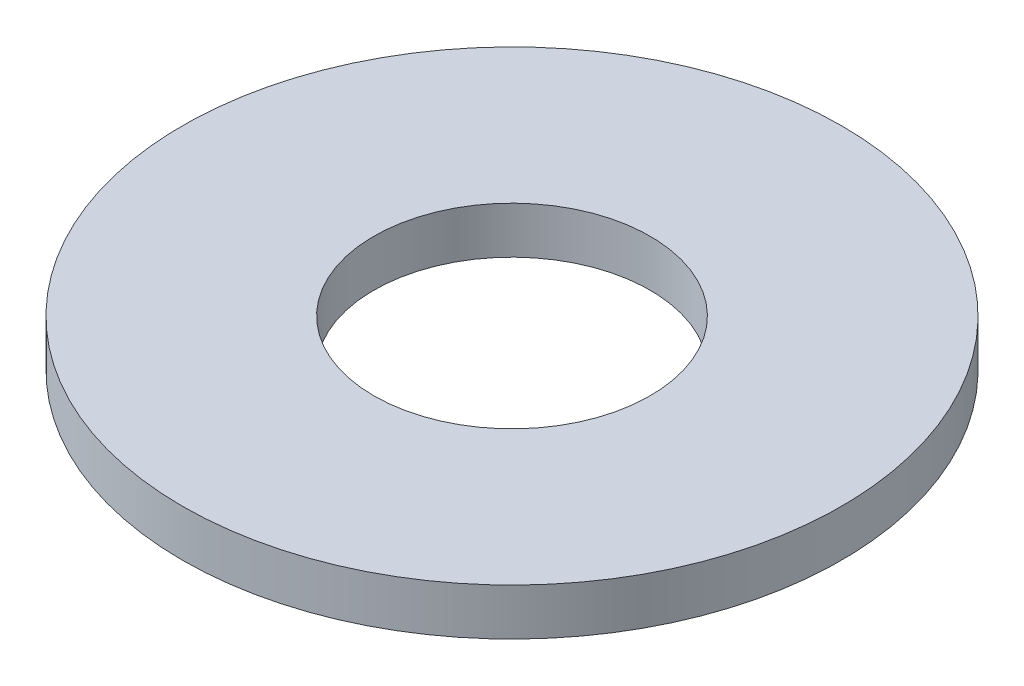
ISO-10303-21;
HEADER;
FILE_DESCRIPTION(('STEP AP214'),'2;1');
FILE_NAME('part.step','',(''),(''),'','','');
FILE_SCHEMA(('AUTOMOTIVE_DESIGN { 1 0 10303 214 1 1 1 1 }'));
ENDSEC;
DATA;
#1=APPLICATION_CONTEXT('core data for automotive mechanical design processes');
#2=APPLICATION_PROTOCOL_DEFINITION('international standard','automotive_design',2000,#1);
#3=PRODUCT_CONTEXT('',#1,'mechanical');
#4=PRODUCT('Part','Part','',(#3));
#5=PRODUCT_RELATED_PRODUCT_CATEGORY('part','',(#4));
#6=PRODUCT_DEFINITION_FORMATION('','',#4);
#7=PRODUCT_DEFINITION_CONTEXT('part definition',#1,'design');
#8=PRODUCT_DEFINITION('design','',#6,#7);
#9=PRODUCT_DEFINITION_SHAPE('','',#8);
#10=(LENGTH_UNIT() NAMED_UNIT(*) SI_UNIT(.MILLI.,.METRE.));
#11=(NAMED_UNIT(*) PLANE_ANGLE_UNIT() SI_UNIT($,.RADIAN.));
#12=(NAMED_UNIT(*) SI_UNIT($,.STERADIAN.) SOLID_ANGLE_UNIT());
#13=UNCERTAINTY_MEASURE_WITH_UNIT(LENGTH_MEASURE(1.E-05),#10,'distance_accuracy_value','');
#14=(GEOMETRIC_REPRESENTATION_CONTEXT(3) GLOBAL_UNCERTAINTY_ASSIGNED_CONTEXT((#13)) GLOBAL_UNIT_ASSIGNED_CONTEXT((#10,
#11,#12)) REPRESENTATION_CONTEXT('',''));
#15=CARTESIAN_POINT('',(0.,0.,0.));
#16=DIRECTION('',(0.,0.,1.));
#17=DIRECTION('',(1.,0.,0.));
#18=AXIS2_PLACEMENT_3D('',#15,#16,#17);
#19=CARTESIAN_POINT('',(0.,11.,0.));
#20=DIRECTION('',(0.,-1.,0.));
#21=DIRECTION('',(0.,0.,-1.));
#22=AXIS2_PLACEMENT_3D('',#19,#20,#21);
#23=CYLINDRICAL_SURFACE('',#22,77.5);
#24=CARTESIAN_POINT('',(0.,11.,0.));
#25=DIRECTION('',(0.,1.,0.));
#26=DIRECTION('',(0.,0.,1.));
#27=AXIS2_PLACEMENT_3D('',#24,#25,#26);
#28=CIRCLE('',#27,77.5);
#29=CARTESIAN_POINT('',(0.,11.,77.5));
#30=VERTEX_POINT('',#29);
#31=EDGE_CURVE('E10',#30,#30,#28,.T.);
#32=ORIENTED_EDGE('',*,*,#31,.F.);
#33=EDGE_LOOP('',(#32));
#34=FACE_BOUND('',#33,.T.);
#35=CARTESIAN_POINT('',(0.,0.,0.));
#36=DIRECTION('',(0.,1.,0.));
#37=DIRECTION('',(0.,0.,1.));
#38=AXIS2_PLACEMENT_3D('',#35,#36,#37);
#39=CIRCLE('',#38,77.5);
#40=CARTESIAN_POINT('',(0.,0.,77.5));
#41=VERTEX_POINT('',#40);
#42=EDGE_CURVE('E37',#41,#41,#39,.T.);
#43=ORIENTED_EDGE('',*,*,#42,.T.);
#44=EDGE_LOOP('',(#43));
#45=FACE_BOUND('',#44,.T.);
#46=ADVANCED_FACE('F40',(#34,#45),#23,.T.);
#47=CARTESIAN_POINT('',(0.,11.,0.));
#48=DIRECTION('',(0.,1.,0.));
#49=DIRECTION('',(0.,0.,1.));
#50=AXIS2_PLACEMENT_3D('',#47,#48,#49);
#51=PLANE('',#50);
#52=CARTESIAN_POINT('',(0.,11.,0.));
#53=DIRECTION('',(0.,1.,0.));
#54=DIRECTION('',(0.,0.,1.));
#55=AXIS2_PLACEMENT_3D('',#52,#53,#54);
#56=CIRCLE('',#55,32.5);
#57=CARTESIAN_POINT('',(0.,11.,32.5));
#58=VERTEX_POINT('',#57);
#59=EDGE_CURVE('E50',#58,#58,#56,.T.);
#60=ORIENTED_EDGE('',*,*,#59,.F.);
#61=EDGE_LOOP('',(#60));
#62=FACE_BOUND('',#61,.T.);
#63=ORIENTED_EDGE('',*,*,#31,.T.);
#64=EDGE_LOOP('',(#63));
#65=FACE_BOUND('',#64,.T.);
#66=ADVANCED_FACE('F59',(#62,#65),#51,.T.);
#67=CARTESIAN_POINT('',(0.,0.,0.));
#68=DIRECTION('',(0.,1.,0.));
#69=DIRECTION('',(0.,0.,1.));
#70=AXIS2_PLACEMENT_3D('',#67,#68,#69);
#71=PLANE('',#70);
#72=CARTESIAN_POINT('',(0.,0.,0.));
#73=DIRECTION('',(0.,1.,0.));
#74=DIRECTION('',(0.,0.,1.));
#75=AXIS2_PLACEMENT_3D('',#72,#73,#74);
#76=CIRCLE('',#75,32.5);
#77=CARTESIAN_POINT('',(0.,0.,32.5));
#78=VERTEX_POINT('',#77);
#79=EDGE_CURVE('E47',#78,#78,#76,.T.);
#80=ORIENTED_EDGE('',*,*,#79,.T.);
#81=EDGE_LOOP('',(#80));
#82=FACE_BOUND('',#81,.T.);
#83=ORIENTED_EDGE('',*,*,#42,.F.);
#84=EDGE_LOOP('',(#83));
#85=FACE_BOUND('',#84,.T.);
#86=ADVANCED_FACE('F58',(#82,#85),#71,.F.);
#87=CARTESIAN_POINT('',(0.,11.,0.));
#88=DIRECTION('',(0.,-1.,0.));
#89=DIRECTION('',(0.,0.,-1.));
#90=AXIS2_PLACEMENT_3D('',#87,#88,#89);
#91=CYLINDRICAL_SURFACE('',#90,32.5);
#92=ORIENTED_EDGE('',*,*,#59,.T.);
#93=EDGE_LOOP('',(#92));
#94=FACE_BOUND('',#93,.T.);
#95=ORIENTED_EDGE('',*,*,#79,.F.);
#96=EDGE_LOOP('',(#95));
#97=FACE_BOUND('',#96,.T.);
#98=ADVANCED_FACE('F54',(#94,#97),#91,.F.);
#99=CLOSED_SHELL('',(#46,#66,#86,#98));
#100=MANIFOLD_SOLID_BREP('B2',#99);
#101=ADVANCED_BREP_SHAPE_REPRESENTATION('',(#18,#100),#14);
#102=SHAPE_DEFINITION_REPRESENTATION(#9,#101);
ENDSEC;
END-ISO-10303-21;
